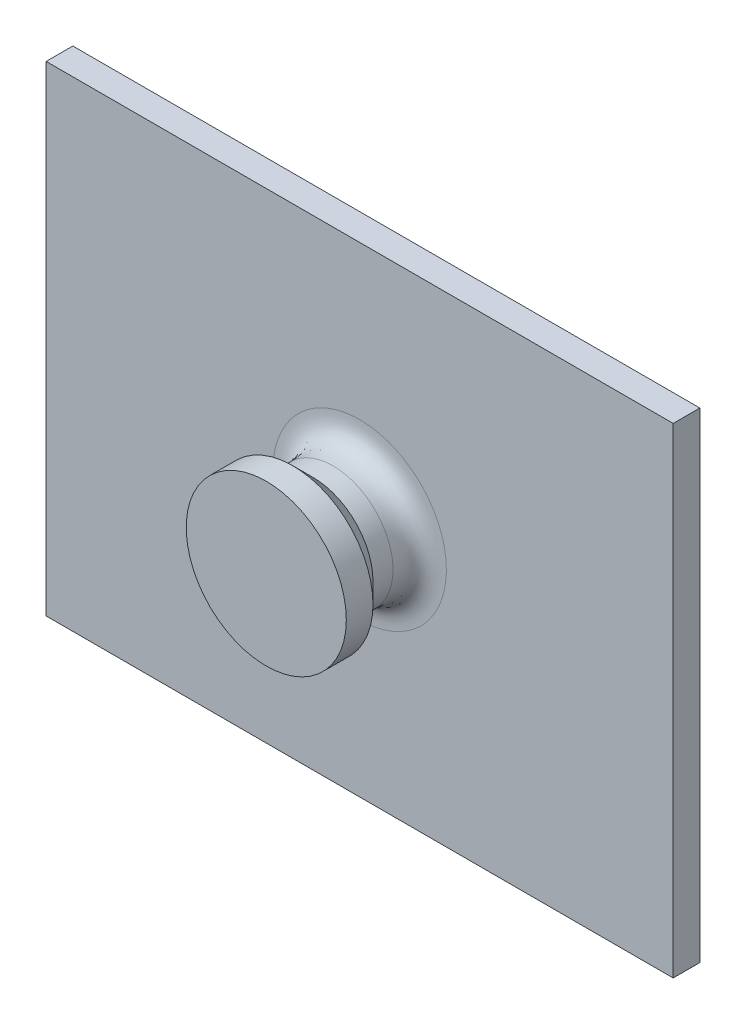
ISO-10303-21;
HEADER;
FILE_DESCRIPTION(('STEP AP214'),'2;1');
FILE_NAME('part.step','',(''),(''),'','','');
FILE_SCHEMA(('AUTOMOTIVE_DESIGN { 1 0 10303 214 1 1 1 1 }'));
ENDSEC;
DATA;
#1=APPLICATION_CONTEXT('core data for automotive mechanical design processes');
#2=APPLICATION_PROTOCOL_DEFINITION('international standard','automotive_design',2000,#1);
#3=PRODUCT_CONTEXT('',#1,'mechanical');
#4=PRODUCT('Part','Part','',(#3));
#5=PRODUCT_RELATED_PRODUCT_CATEGORY('part','',(#4));
#6=PRODUCT_DEFINITION_FORMATION('','',#4);
#7=PRODUCT_DEFINITION_CONTEXT('part definition',#1,'design');
#8=PRODUCT_DEFINITION('design','',#6,#7);
#9=PRODUCT_DEFINITION_SHAPE('','',#8);
#10=(LENGTH_UNIT() NAMED_UNIT(*) SI_UNIT(.MILLI.,.METRE.));
#11=(NAMED_UNIT(*) PLANE_ANGLE_UNIT() SI_UNIT($,.RADIAN.));
#12=(NAMED_UNIT(*) SI_UNIT($,.STERADIAN.) SOLID_ANGLE_UNIT());
#13=UNCERTAINTY_MEASURE_WITH_UNIT(LENGTH_MEASURE(1.E-05),#10,'distance_accuracy_value','');
#14=(GEOMETRIC_REPRESENTATION_CONTEXT(3) GLOBAL_UNCERTAINTY_ASSIGNED_CONTEXT((#13)) GLOBAL_UNIT_ASSIGNED_CONTEXT((#10,
#11,#12)) REPRESENTATION_CONTEXT('',''));
#15=CARTESIAN_POINT('',(0.,0.,0.));
#16=DIRECTION('',(0.,0.,1.));
#17=DIRECTION('',(1.,0.,0.));
#18=AXIS2_PLACEMENT_3D('',#15,#16,#17);
#19=CARTESIAN_POINT('',(0.,10.3478260869565,2.));
#20=DIRECTION('',(1.,0.,0.));
#21=DIRECTION('',(0.,0.,-1.));
#22=AXIS2_PLACEMENT_3D('',#19,#20,#21);
#23=PLANE('',#22);
#24=DIRECTION('',(0.,-1.,0.));
#25=VECTOR('',#24,1.);
#26=CARTESIAN_POINT('',(0.,10.3478260869565,0.));
#27=LINE('',#26,#25);
#28=CARTESIAN_POINT('',(0.,46.3478260869565,0.));
#29=VERTEX_POINT('',#28);
#30=CARTESIAN_POINT('',(0.,10.3478260869565,0.));
#31=VERTEX_POINT('',#30);
#32=EDGE_CURVE('E119',#29,#31,#27,.T.);
#33=ORIENTED_EDGE('',*,*,#32,.T.);
#34=DIRECTION('',(0.,0.,-1.));
#35=VECTOR('',#34,1.);
#36=CARTESIAN_POINT('',(0.,10.3478260869565,2.));
#37=LINE('',#36,#35);
#38=CARTESIAN_POINT('',(0.,10.3478260869565,2.));
#39=VERTEX_POINT('',#38);
#40=EDGE_CURVE('E108',#39,#31,#37,.T.);
#41=ORIENTED_EDGE('',*,*,#40,.F.);
#42=DIRECTION('',(0.,-1.,0.));
#43=VECTOR('',#42,1.);
#44=CARTESIAN_POINT('',(0.,10.3478260869565,2.));
#45=LINE('',#44,#43);
#46=CARTESIAN_POINT('',(0.,46.3478260869565,2.));
#47=VERTEX_POINT('',#46);
#48=EDGE_CURVE('E100',#47,#39,#45,.T.);
#49=ORIENTED_EDGE('',*,*,#48,.F.);
#50=DIRECTION('',(0.,0.,-1.));
#51=VECTOR('',#50,1.);
#52=CARTESIAN_POINT('',(0.,46.3478260869565,2.));
#53=LINE('',#52,#51);
#54=EDGE_CURVE('E115',#47,#29,#53,.T.);
#55=ORIENTED_EDGE('',*,*,#54,.T.);
#56=EDGE_LOOP('',(#33,#41,#49,#55));
#57=FACE_BOUND('',#56,.T.);
#58=ADVANCED_FACE('F45',(#57),#23,.F.);
#59=CARTESIAN_POINT('',(0.,10.3478260869565,2.));
#60=DIRECTION('',(0.,1.,0.));
#61=DIRECTION('',(0.,0.,1.));
#62=AXIS2_PLACEMENT_3D('',#59,#60,#61);
#63=PLANE('',#62);
#64=DIRECTION('',(1.,0.,0.));
#65=VECTOR('',#64,1.);
#66=CARTESIAN_POINT('',(0.,10.3478260869565,0.));
#67=LINE('',#66,#65);
#68=CARTESIAN_POINT('',(47.,10.3478260869565,0.));
#69=VERTEX_POINT('',#68);
#70=EDGE_CURVE('E106',#31,#69,#67,.T.);
#71=ORIENTED_EDGE('',*,*,#70,.T.);
#72=DIRECTION('',(0.,0.,-1.));
#73=VECTOR('',#72,1.);
#74=CARTESIAN_POINT('',(47.,10.3478260869565,2.));
#75=LINE('',#74,#73);
#76=CARTESIAN_POINT('',(47.,10.3478260869565,2.));
#77=VERTEX_POINT('',#76);
#78=EDGE_CURVE('E104',#77,#69,#75,.T.);
#79=ORIENTED_EDGE('',*,*,#78,.F.);
#80=DIRECTION('',(1.,0.,0.));
#81=VECTOR('',#80,1.);
#82=CARTESIAN_POINT('',(0.,10.3478260869565,2.));
#83=LINE('',#82,#81);
#84=EDGE_CURVE('E95',#39,#77,#83,.T.);
#85=ORIENTED_EDGE('',*,*,#84,.F.);
#86=ORIENTED_EDGE('',*,*,#40,.T.);
#87=EDGE_LOOP('',(#71,#79,#85,#86));
#88=FACE_BOUND('',#87,.T.);
#89=ADVANCED_FACE('F105',(#88),#63,.F.);
#90=CARTESIAN_POINT('',(47.,10.3478260869565,2.));
#91=DIRECTION('',(-1.,0.,0.));
#92=DIRECTION('',(0.,-1.,0.));
#93=AXIS2_PLACEMENT_3D('',#90,#91,#92);
#94=PLANE('',#93);
#95=DIRECTION('',(0.,1.,0.));
#96=VECTOR('',#95,1.);
#97=CARTESIAN_POINT('',(47.,10.3478260869565,0.));
#98=LINE('',#97,#96);
#99=CARTESIAN_POINT('',(47.,46.3478260869565,0.));
#100=VERTEX_POINT('',#99);
#101=EDGE_CURVE('E81',#69,#100,#98,.T.);
#102=ORIENTED_EDGE('',*,*,#101,.T.);
#103=DIRECTION('',(0.,0.,-1.));
#104=VECTOR('',#103,1.);
#105=CARTESIAN_POINT('',(47.,46.3478260869565,2.));
#106=LINE('',#105,#104);
#107=CARTESIAN_POINT('',(47.,46.3478260869565,2.));
#108=VERTEX_POINT('',#107);
#109=EDGE_CURVE('E109',#108,#100,#106,.T.);
#110=ORIENTED_EDGE('',*,*,#109,.F.);
#111=DIRECTION('',(0.,1.,0.));
#112=VECTOR('',#111,1.);
#113=CARTESIAN_POINT('',(47.,10.3478260869565,2.));
#114=LINE('',#113,#112);
#115=EDGE_CURVE('E98',#77,#108,#114,.T.);
#116=ORIENTED_EDGE('',*,*,#115,.F.);
#117=ORIENTED_EDGE('',*,*,#78,.T.);
#118=EDGE_LOOP('',(#102,#110,#116,#117));
#119=FACE_BOUND('',#118,.T.);
#120=ADVANCED_FACE('F111',(#119),#94,.F.);
#121=CARTESIAN_POINT('',(0.,46.3478260869565,2.));
#122=DIRECTION('',(0.,-1.,0.));
#123=DIRECTION('',(0.,0.,-1.));
#124=AXIS2_PLACEMENT_3D('',#121,#122,#123);
#125=PLANE('',#124);
#126=DIRECTION('',(-1.,0.,0.));
#127=VECTOR('',#126,1.);
#128=CARTESIAN_POINT('',(0.,46.3478260869565,0.));
#129=LINE('',#128,#127);
#130=EDGE_CURVE('E87',#100,#29,#129,.T.);
#131=ORIENTED_EDGE('',*,*,#130,.T.);
#132=ORIENTED_EDGE('',*,*,#54,.F.);
#133=DIRECTION('',(-1.,0.,0.));
#134=VECTOR('',#133,1.);
#135=CARTESIAN_POINT('',(0.,46.3478260869565,2.));
#136=LINE('',#135,#134);
#137=EDGE_CURVE('E64',#108,#47,#136,.T.);
#138=ORIENTED_EDGE('',*,*,#137,.F.);
#139=ORIENTED_EDGE('',*,*,#109,.T.);
#140=EDGE_LOOP('',(#131,#132,#138,#139));
#141=FACE_BOUND('',#140,.T.);
#142=ADVANCED_FACE('F164',(#141),#125,.F.);
#143=CARTESIAN_POINT('',(0.,0.,2.));
#144=DIRECTION('',(0.,0.,-1.));
#145=DIRECTION('',(-1.,0.,0.));
#146=AXIS2_PLACEMENT_3D('',#143,#144,#145);
#147=PLANE('',#146);
#148=CARTESIAN_POINT('',(30.,28.3478260869565,2.));
#149=CARTESIAN_POINT('',(30.,29.1985596013557,2.));
#150=CARTESIAN_POINT('',(29.6615571652833,30.900026630154,2.));
#151=CARTESIAN_POINT('',(28.2158516894486,33.0636777764052,2.));
#152=CARTESIAN_POINT('',(26.0522005431975,34.5093832522398,2.));
#153=CARTESIAN_POINT('',(23.5,35.0170475043149,2.));
#154=CARTESIAN_POINT('',(20.9477994568025,34.5093832522398,2.));
#155=CARTESIAN_POINT('',(18.7841483105513,33.0636777764052,2.));
#156=CARTESIAN_POINT('',(17.3384428347167,30.900026630154,2.));
#157=CARTESIAN_POINT('',(16.8307785826416,28.3478260869565,2.));
#158=CARTESIAN_POINT('',(17.3384428347167,25.7956255437591,2.));
#159=CARTESIAN_POINT('',(18.7841483105513,23.6319743975079,2.));
#160=CARTESIAN_POINT('',(20.9477994568025,22.1862689216732,2.));
#161=CARTESIAN_POINT('',(23.5,21.6786046695982,2.));
#162=CARTESIAN_POINT('',(26.0522005431975,22.1862689216733,2.));
#163=CARTESIAN_POINT('',(28.2158516894486,23.6319743975079,2.));
#164=CARTESIAN_POINT('',(29.6615571652833,25.7956255437591,2.));
#165=CARTESIAN_POINT('',(30.,27.4970925725574,2.));
#166=CARTESIAN_POINT('',(30.,28.3478260869565,2.));
#167=B_SPLINE_CURVE_WITH_KNOTS('',3,(#148,#149,#150,#151,#152,#153,#154,#155,#156,#157,#158,
#159,#160,#161,#162,#163,#164,#165,#166),.UNSPECIFIED.,.T.,.F.,(4,1,1,1,1,1,1,1,1,1,1,1,1,1,1,1,
4),(-3.14159265358979,-2.74889357189107,-2.35619449019234,-1.96349540849362,-1.5707963267949,
-1.17809724509617,-0.785398163397448,-0.392699081698724,0.,0.392699081698724,0.785398163397448,
1.17809724509617,1.5707963267949,1.96349540849362,2.35619449019235,2.74889357189107,
3.14159265358979),.UNSPECIFIED.);
#168=CARTESIAN_POINT('',(30.,28.3478260869565,2.));
#169=VERTEX_POINT('',#168);
#170=EDGE_CURVE('E56',#169,#169,#167,.F.);
#171=ORIENTED_EDGE('',*,*,#170,.T.);
#172=EDGE_LOOP('',(#171));
#173=FACE_BOUND('',#172,.T.);
#174=ORIENTED_EDGE('',*,*,#48,.T.);
#175=ORIENTED_EDGE('',*,*,#84,.T.);
#176=ORIENTED_EDGE('',*,*,#115,.T.);
#177=ORIENTED_EDGE('',*,*,#137,.T.);
#178=EDGE_LOOP('',(#174,#175,#176,#177));
#179=FACE_BOUND('',#178,.T.);
#180=ADVANCED_FACE('F96',(#173,#179),#147,.F.);
#181=CARTESIAN_POINT('',(0.,0.,0.));
#182=DIRECTION('',(0.,0.,-1.));
#183=DIRECTION('',(-1.,0.,0.));
#184=AXIS2_PLACEMENT_3D('',#181,#182,#183);
#185=PLANE('',#184);
#186=ORIENTED_EDGE('',*,*,#32,.F.);
#187=ORIENTED_EDGE('',*,*,#130,.F.);
#188=ORIENTED_EDGE('',*,*,#101,.F.);
#189=ORIENTED_EDGE('',*,*,#70,.F.);
#190=EDGE_LOOP('',(#186,#187,#188,#189));
#191=FACE_BOUND('',#190,.T.);
#192=ADVANCED_FACE('F158',(#191),#185,.T.);
#193=CARTESIAN_POINT('',(23.5,28.3478260869565,7.));
#194=DIRECTION('',(0.,0.,-1.));
#195=DIRECTION('',(-1.,0.,0.));
#196=AXIS2_PLACEMENT_3D('',#193,#194,#195);
#197=CYLINDRICAL_SURFACE('',#196,4.5);
#198=CARTESIAN_POINT('',(23.5,28.3478260869565,5.50000000000002));
#199=DIRECTION('',(0.,0.,1.));
#200=DIRECTION('',(1.,0.,0.));
#201=AXIS2_PLACEMENT_3D('',#198,#199,#200);
#202=CIRCLE('',#201,4.5);
#203=CARTESIAN_POINT('',(28.,28.3478260869565,5.50000000000002));
#204=VERTEX_POINT('',#203);
#205=EDGE_CURVE('E11',#204,#204,#202,.F.);
#206=ORIENTED_EDGE('',*,*,#205,.T.);
#207=EDGE_LOOP('',(#206));
#208=FACE_BOUND('',#207,.T.);
#209=CARTESIAN_POINT('',(28.,28.3478260869565,4.));
#210=CARTESIAN_POINT('',(28.,27.758856730834,4.));
#211=CARTESIAN_POINT('',(27.7656934221192,26.5809180185891,4.));
#212=CARTESIAN_POINT('',(26.7648204003875,25.083005686569,4.));
#213=CARTESIAN_POINT('',(25.2669080683675,24.0821326648373,4.));
#214=CARTESIAN_POINT('',(23.5,23.7306727980161,4.));
#215=CARTESIAN_POINT('',(21.7330919316325,24.0821326648373,4.));
#216=CARTESIAN_POINT('',(20.2351795996125,25.083005686569,4.));
#217=CARTESIAN_POINT('',(19.2343065778808,26.5809180185891,4.));
#218=CARTESIAN_POINT('',(18.8828467110596,28.3478260869565,4.));
#219=CARTESIAN_POINT('',(19.2343065778808,30.114734155324,4.));
#220=CARTESIAN_POINT('',(20.2351795996125,31.6126464873441,4.));
#221=CARTESIAN_POINT('',(21.7330919316325,32.6135195090758,4.));
#222=CARTESIAN_POINT('',(23.5,32.9649793758969,4.));
#223=CARTESIAN_POINT('',(25.2669080683675,32.6135195090758,4.));
#224=CARTESIAN_POINT('',(26.7648204003875,31.612646487344,4.));
#225=CARTESIAN_POINT('',(27.7656934221192,30.114734155324,4.));
#226=CARTESIAN_POINT('',(28.,28.936795443079,4.));
#227=CARTESIAN_POINT('',(28.,28.3478260869565,4.));
#228=B_SPLINE_CURVE_WITH_KNOTS('',3,(#209,#210,#211,#212,#213,#214,#215,#216,#217,#218,#219,
#220,#221,#222,#223,#224,#225,#226,#227),.UNSPECIFIED.,.T.,.F.,(4,1,1,1,1,1,1,1,1,1,1,1,1,1,1,1,
4),(-3.14159265358979,-2.74889357189107,-2.35619449019235,-1.96349540849362,-1.5707963267949,
-1.17809724509617,-0.785398163397448,-0.392699081698724,0.,0.392699081698724,0.785398163397448,
1.17809724509617,1.5707963267949,1.96349540849362,2.35619449019234,2.74889357189107,
3.14159265358979),.UNSPECIFIED.);
#229=CARTESIAN_POINT('',(28.,28.3478260869565,4.));
#230=VERTEX_POINT('',#229);
#231=EDGE_CURVE('E136',#230,#230,#228,.F.);
#232=ORIENTED_EDGE('',*,*,#231,.T.);
#233=EDGE_LOOP('',(#232));
#234=FACE_BOUND('',#233,.T.);
#235=ADVANCED_FACE('F147',(#208,#234),#197,.T.);
#236=CARTESIAN_POINT('',(23.5,28.3478260869565,9.));
#237=DIRECTION('',(0.,0.,-1.));
#238=DIRECTION('',(-1.,0.,0.));
#239=AXIS2_PLACEMENT_3D('',#236,#237,#238);
#240=CYLINDRICAL_SURFACE('',#239,6.);
#241=CARTESIAN_POINT('',(23.5,28.3478260869565,9.));
#242=DIRECTION('',(0.,0.,1.));
#243=DIRECTION('',(1.,0.,0.));
#244=AXIS2_PLACEMENT_3D('',#241,#242,#243);
#245=CIRCLE('',#244,6.);
#246=CARTESIAN_POINT('',(29.5,28.3478260869565,9.));
#247=VERTEX_POINT('',#246);
#248=EDGE_CURVE('E123',#247,#247,#245,.T.);
#249=ORIENTED_EDGE('',*,*,#248,.F.);
#250=EDGE_LOOP('',(#249));
#251=FACE_BOUND('',#250,.T.);
#252=CARTESIAN_POINT('',(23.5,28.3478260869565,7.));
#253=DIRECTION('',(0.,0.,1.));
#254=DIRECTION('',(1.,0.,0.));
#255=AXIS2_PLACEMENT_3D('',#252,#253,#254);
#256=CIRCLE('',#255,6.);
#257=CARTESIAN_POINT('',(29.5,28.3478260869565,7.));
#258=VERTEX_POINT('',#257);
#259=EDGE_CURVE('E317',#258,#258,#256,.T.);
#260=ORIENTED_EDGE('',*,*,#259,.T.);
#261=EDGE_LOOP('',(#260));
#262=FACE_BOUND('',#261,.T.);
#263=ADVANCED_FACE('F157',(#251,#262),#240,.T.);
#264=CARTESIAN_POINT('',(23.5,28.3478260869565,9.));
#265=DIRECTION('',(0.,0.,1.));
#266=DIRECTION('',(1.,0.,0.));
#267=AXIS2_PLACEMENT_3D('',#264,#265,#266);
#268=PLANE('',#267);
#269=ORIENTED_EDGE('',*,*,#248,.T.);
#270=EDGE_LOOP('',(#269));
#271=FACE_BOUND('',#270,.T.);
#272=ADVANCED_FACE('F195',(#271),#268,.T.);
#273=CARTESIAN_POINT('',(30.,28.3478260869565,2.));
#274=CARTESIAN_POINT('',(30.,27.4970925725574,2.));
#275=CARTESIAN_POINT('',(29.6615571652833,25.7956255437591,2.));
#276=CARTESIAN_POINT('',(28.2158516894486,23.6319743975079,2.));
#277=CARTESIAN_POINT('',(26.0522005431975,22.1862689216733,2.));
#278=CARTESIAN_POINT('',(23.5,21.6786046695982,2.));
#279=CARTESIAN_POINT('',(20.9477994568025,22.1862689216732,2.));
#280=CARTESIAN_POINT('',(18.7841483105513,23.6319743975079,2.));
#281=CARTESIAN_POINT('',(17.3384428347167,25.7956255437591,2.));
#282=CARTESIAN_POINT('',(16.8307785826416,28.3478260869565,2.));
#283=CARTESIAN_POINT('',(17.3384428347167,30.900026630154,2.));
#284=CARTESIAN_POINT('',(18.7841483105513,33.0636777764052,2.));
#285=CARTESIAN_POINT('',(20.9477994568025,34.5093832522398,2.));
#286=CARTESIAN_POINT('',(23.5,35.0170475043149,2.));
#287=CARTESIAN_POINT('',(26.0522005431975,34.5093832522398,2.));
#288=CARTESIAN_POINT('',(28.2158516894486,33.0636777764052,2.));
#289=CARTESIAN_POINT('',(29.6615571652833,30.900026630154,2.));
#290=CARTESIAN_POINT('',(30.,29.1985596013557,2.));
#291=CARTESIAN_POINT('',(30.,28.3478260869565,2.));
#292=CARTESIAN_POINT('',(29.6636038969321,28.3478260869565,2.));
#293=CARTESIAN_POINT('',(29.6636038969321,27.5411207939409,2.));
#294=CARTESIAN_POINT('',(29.3426765777093,25.9277102079098,2.));
#295=CARTESIAN_POINT('',(27.9717910539137,23.8760350330427,2.));
#296=CARTESIAN_POINT('',(25.9201158790468,22.5051495092473,2.));
#297=CARTESIAN_POINT('',(23.5,22.023758530413,2.));
#298=CARTESIAN_POINT('',(21.0798841209532,22.5051495092473,2.));
#299=CARTESIAN_POINT('',(19.0282089460862,23.8760350330428,2.));
#300=CARTESIAN_POINT('',(17.6573234222908,25.9277102079097,2.));
#301=CARTESIAN_POINT('',(17.1759324434564,28.3478260869565,2.));
#302=CARTESIAN_POINT('',(17.6573234222908,30.7679419660033,2.));
#303=CARTESIAN_POINT('',(19.0282089460862,32.8196171408703,2.));
#304=CARTESIAN_POINT('',(21.0798841209532,34.1905026646658,2.));
#305=CARTESIAN_POINT('',(23.5,34.6718936435001,2.));
#306=CARTESIAN_POINT('',(25.9201158790468,34.1905026646658,2.));
#307=CARTESIAN_POINT('',(27.9717910539138,32.8196171408703,2.));
#308=CARTESIAN_POINT('',(29.3426765777092,30.7679419660033,2.));
#309=CARTESIAN_POINT('',(29.6636038969321,29.1545313799721,2.));
#310=CARTESIAN_POINT('',(29.6636038969321,28.3478260869565,2.));
#311=CARTESIAN_POINT('',(29.3272077938642,28.3478260869565,2.));
#312=CARTESIAN_POINT('',(29.3272077938642,27.5851490153245,2.));
#313=CARTESIAN_POINT('',(29.0237959901352,26.0597948720604,2.));
#314=CARTESIAN_POINT('',(27.7277304183789,24.1200956685776,2.));
#315=CARTESIAN_POINT('',(25.7880312148961,22.8240300968213,2.));
#316=CARTESIAN_POINT('',(23.5,22.3689123912278,2.));
#317=CARTESIAN_POINT('',(21.2119687851039,22.8240300968213,2.));
#318=CARTESIAN_POINT('',(19.2722695816211,24.1200956685776,2.));
#319=CARTESIAN_POINT('',(17.9762040098648,26.0597948720604,2.));
#320=CARTESIAN_POINT('',(17.5210863042713,28.3478260869565,2.));
#321=CARTESIAN_POINT('',(17.9762040098648,30.6358573018527,2.));
#322=CARTESIAN_POINT('',(19.2722695816211,32.5755565053354,2.));
#323=CARTESIAN_POINT('',(21.2119687851039,33.8716220770917,2.));
#324=CARTESIAN_POINT('',(23.5,34.3267397826852,2.));
#325=CARTESIAN_POINT('',(25.7880312148961,33.8716220770917,2.));
#326=CARTESIAN_POINT('',(27.7277304183789,32.5755565053354,2.));
#327=CARTESIAN_POINT('',(29.0237959901352,30.6358573018527,2.));
#328=CARTESIAN_POINT('',(29.3272077938642,29.1105031585886,2.));
#329=CARTESIAN_POINT('',(29.3272077938642,28.3478260869565,2.));
#330=CARTESIAN_POINT('',(28.5857864376269,28.3478260869565,2.14338383967217));
#331=CARTESIAN_POINT('',(28.5857864376269,27.6821877839464,2.14338383967217));
#332=CARTESIAN_POINT('',(28.3209790562863,26.3509111779261,2.14338383967217));
#333=CARTESIAN_POINT('',(27.1898176252396,24.6580084617168,2.14338383967216));
#334=CARTESIAN_POINT('',(25.4969149090304,23.5268470306703,2.14338383967217));
#335=CARTESIAN_POINT('',(23.5,23.1296359586593,2.14338383967217));
#336=CARTESIAN_POINT('',(21.5030850909696,23.5268470306703,2.14338383967217));
#337=CARTESIAN_POINT('',(19.8101823747603,24.6580084617169,2.14338383967217));
#338=CARTESIAN_POINT('',(18.6790209437137,26.3509111779261,2.14338383967217));
#339=CARTESIAN_POINT('',(18.2818098717028,28.3478260869565,2.14338383967217));
#340=CARTESIAN_POINT('',(18.6790209437137,30.3447409959869,2.14338383967217));
#341=CARTESIAN_POINT('',(19.8101823747603,32.0376437121962,2.14338383967217));
#342=CARTESIAN_POINT('',(21.5030850909696,33.1688051432428,2.14338383967217));
#343=CARTESIAN_POINT('',(23.5,33.5660162152537,2.14338383967217));
#344=CARTESIAN_POINT('',(25.4969149090304,33.1688051432428,2.14338383967216));
#345=CARTESIAN_POINT('',(27.1898176252397,32.0376437121962,2.14338383967217));
#346=CARTESIAN_POINT('',(28.3209790562862,30.344740995987,2.14338383967216));
#347=CARTESIAN_POINT('',(28.5857864376269,29.0134643899667,2.14338383967217));
#348=CARTESIAN_POINT('',(28.5857864376269,28.3478260869565,2.14338383967217));
#349=CARTESIAN_POINT('',(28.1433838396722,28.3478260869565,2.5857864376269));
#350=CARTESIAN_POINT('',(28.1433838396722,27.7400903557829,2.5857864376269));
#351=CARTESIAN_POINT('',(27.9016115336143,26.5246188934357,2.58578643762691));
#352=CARTESIAN_POINT('',(26.8688476192425,24.978978467714,2.5857864376269));
#353=CARTESIAN_POINT('',(25.3232071935209,23.9462145533423,2.58578643762691));
#354=CARTESIAN_POINT('',(23.5,23.5835560942554,2.5857864376269));
#355=CARTESIAN_POINT('',(21.6767928064791,23.9462145533423,2.58578643762691));
#356=CARTESIAN_POINT('',(20.1311523807574,24.978978467714,2.5857864376269));
#357=CARTESIAN_POINT('',(19.0983884663857,26.5246188934357,2.58578643762691));
#358=CARTESIAN_POINT('',(18.7357300072989,28.3478260869565,2.5857864376269));
#359=CARTESIAN_POINT('',(19.0983884663857,30.1710332804774,2.58578643762691));
#360=CARTESIAN_POINT('',(20.1311523807574,31.7166737061991,2.5857864376269));
#361=CARTESIAN_POINT('',(21.6767928064791,32.7494376205708,2.58578643762691));
#362=CARTESIAN_POINT('',(23.5,33.1120960796576,2.5857864376269));
#363=CARTESIAN_POINT('',(25.3232071935209,32.7494376205708,2.58578643762691));
#364=CARTESIAN_POINT('',(26.8688476192425,31.7166737061991,2.5857864376269));
#365=CARTESIAN_POINT('',(27.9016115336143,30.1710332804774,2.58578643762691));
#366=CARTESIAN_POINT('',(28.1433838396722,28.9555618181302,2.5857864376269));
#367=CARTESIAN_POINT('',(28.1433838396722,28.3478260869565,2.5857864376269));
#368=CARTESIAN_POINT('',(28.,28.3478260869565,3.32720779386422));
#369=CARTESIAN_POINT('',(28.,27.758856730834,3.32720779386422));
#370=CARTESIAN_POINT('',(27.7656934221192,26.5809180185891,3.32720779386422));
#371=CARTESIAN_POINT('',(26.7648204003875,25.083005686569,3.32720779386421));
#372=CARTESIAN_POINT('',(25.2669080683675,24.0821326648373,3.32720779386422));
#373=CARTESIAN_POINT('',(23.5,23.7306727980161,3.32720779386421));
#374=CARTESIAN_POINT('',(21.7330919316325,24.0821326648373,3.32720779386421));
#375=CARTESIAN_POINT('',(20.2351795996125,25.083005686569,3.32720779386422));
#376=CARTESIAN_POINT('',(19.2343065778808,26.5809180185891,3.32720779386421));
#377=CARTESIAN_POINT('',(18.8828467110596,28.3478260869565,3.32720779386421));
#378=CARTESIAN_POINT('',(19.2343065778808,30.114734155324,3.32720779386421));
#379=CARTESIAN_POINT('',(20.2351795996125,31.6126464873441,3.32720779386422));
#380=CARTESIAN_POINT('',(21.7330919316325,32.6135195090758,3.32720779386422));
#381=CARTESIAN_POINT('',(23.5,32.9649793758969,3.32720779386421));
#382=CARTESIAN_POINT('',(25.2669080683675,32.6135195090758,3.32720779386421));
#383=CARTESIAN_POINT('',(26.7648204003875,31.612646487344,3.32720779386422));
#384=CARTESIAN_POINT('',(27.7656934221192,30.114734155324,3.32720779386421));
#385=CARTESIAN_POINT('',(28.,28.936795443079,3.32720779386422));
#386=CARTESIAN_POINT('',(28.,28.3478260869565,3.32720779386422));
#387=CARTESIAN_POINT('',(28.,28.3478260869565,3.66360389693211));
#388=CARTESIAN_POINT('',(28.,27.758856730834,3.66360389693211));
#389=CARTESIAN_POINT('',(27.7656934221192,26.5809180185891,3.66360389693211));
#390=CARTESIAN_POINT('',(26.7648204003875,25.083005686569,3.66360389693211));
#391=CARTESIAN_POINT('',(25.2669080683675,24.0821326648373,3.66360389693211));
#392=CARTESIAN_POINT('',(23.5,23.7306727980161,3.66360389693211));
#393=CARTESIAN_POINT('',(21.7330919316325,24.0821326648373,3.66360389693211));
#394=CARTESIAN_POINT('',(20.2351795996125,25.083005686569,3.66360389693211));
#395=CARTESIAN_POINT('',(19.2343065778808,26.5809180185891,3.66360389693211));
#396=CARTESIAN_POINT('',(18.8828467110596,28.3478260869565,3.66360389693211));
#397=CARTESIAN_POINT('',(19.2343065778808,30.114734155324,3.66360389693211));
#398=CARTESIAN_POINT('',(20.2351795996125,31.6126464873441,3.66360389693211));
#399=CARTESIAN_POINT('',(21.7330919316325,32.6135195090758,3.66360389693211));
#400=CARTESIAN_POINT('',(23.5,32.9649793758969,3.66360389693211));
#401=CARTESIAN_POINT('',(25.2669080683675,32.6135195090758,3.66360389693211));
#402=CARTESIAN_POINT('',(26.7648204003875,31.612646487344,3.66360389693211));
#403=CARTESIAN_POINT('',(27.7656934221192,30.114734155324,3.66360389693211));
#404=CARTESIAN_POINT('',(28.,28.936795443079,3.66360389693211));
#405=CARTESIAN_POINT('',(28.,28.3478260869565,3.66360389693211));
#406=CARTESIAN_POINT('',(28.,28.3478260869565,4.));
#407=CARTESIAN_POINT('',(28.,27.758856730834,4.));
#408=CARTESIAN_POINT('',(27.7656934221192,26.5809180185891,4.));
#409=CARTESIAN_POINT('',(26.7648204003875,25.083005686569,4.));
#410=CARTESIAN_POINT('',(25.2669080683675,24.0821326648373,4.));
#411=CARTESIAN_POINT('',(23.5,23.7306727980161,4.));
#412=CARTESIAN_POINT('',(21.7330919316325,24.0821326648373,4.));
#413=CARTESIAN_POINT('',(20.2351795996125,25.083005686569,4.));
#414=CARTESIAN_POINT('',(19.2343065778808,26.5809180185891,4.));
#415=CARTESIAN_POINT('',(18.8828467110596,28.3478260869565,4.));
#416=CARTESIAN_POINT('',(19.2343065778808,30.114734155324,4.));
#417=CARTESIAN_POINT('',(20.2351795996125,31.6126464873441,4.));
#418=CARTESIAN_POINT('',(21.7330919316325,32.6135195090758,4.));
#419=CARTESIAN_POINT('',(23.5,32.9649793758969,4.));
#420=CARTESIAN_POINT('',(25.2669080683675,32.6135195090758,4.));
#421=CARTESIAN_POINT('',(26.7648204003875,31.612646487344,4.));
#422=CARTESIAN_POINT('',(27.7656934221192,30.114734155324,4.));
#423=CARTESIAN_POINT('',(28.,28.936795443079,4.));
#424=CARTESIAN_POINT('',(28.,28.3478260869565,4.));
#425=B_SPLINE_SURFACE_WITH_KNOTS('',5,3,((#273,#274,#275,#276,#277,#278,#279,#280,#281,#282,
#283,#284,#285,#286,#287,#288,#289,#290,#291),(#292,#293,#294,#295,#296,#297,#298,#299,#300,
#301,#302,#303,#304,#305,#306,#307,#308,#309,#310),(#311,#312,#313,#314,#315,#316,#317,#318,
#319,#320,#321,#322,#323,#324,#325,#326,#327,#328,#329),(#330,#331,#332,#333,#334,#335,#336,
#337,#338,#339,#340,#341,#342,#343,#344,#345,#346,#347,#348),(#349,#350,#351,#352,#353,#354,
#355,#356,#357,#358,#359,#360,#361,#362,#363,#364,#365,#366,#367),(#368,#369,#370,#371,#372,
#373,#374,#375,#376,#377,#378,#379,#380,#381,#382,#383,#384,#385,#386),(#387,#388,#389,#390,
#391,#392,#393,#394,#395,#396,#397,#398,#399,#400,#401,#402,#403,#404,#405),(#406,#407,#408,
#409,#410,#411,#412,#413,#414,#415,#416,#417,#418,#419,#420,#421,#422,#423,#424)),.UNSPECIFIED.,
.F.,.T.,.F.,(6,2,6),(4,1,1,1,1,1,1,1,1,1,1,1,1,1,1,1,4),(0.,0.5,1.),(-3.14159265358979,
-2.74889357189107,-2.35619449019235,-1.96349540849362,-1.5707963267949,-1.17809724509617,
-0.785398163397448,-0.392699081698724,0.,0.392699081698724,0.785398163397448,1.17809724509617,
1.5707963267949,1.96349540849362,2.35619449019234,2.74889357189107,3.14159265358979),.UNSPECIFIED.);
#426=ORIENTED_EDGE('',*,*,#170,.F.);
#427=EDGE_LOOP('',(#426));
#428=FACE_BOUND('',#427,.T.);
#429=ORIENTED_EDGE('',*,*,#231,.F.);
#430=EDGE_LOOP('',(#429));
#431=FACE_BOUND('',#430,.T.);
#432=ADVANCED_FACE('F182',(#428,#431),#425,.T.);
#433=CARTESIAN_POINT('',(23.5,28.3478260869565,7.));
#434=DIRECTION('',(0.,0.,1.));
#435=DIRECTION('',(1.,0.,0.));
#436=AXIS2_PLACEMENT_3D('',#433,#434,#435);
#437=CONICAL_SURFACE('',#436,6.,0.785398163397453);
#438=ORIENTED_EDGE('',*,*,#205,.F.);
#439=EDGE_LOOP('',(#438));
#440=FACE_BOUND('',#439,.T.);
#441=ORIENTED_EDGE('',*,*,#259,.F.);
#442=EDGE_LOOP('',(#441));
#443=FACE_BOUND('',#442,.T.);
#444=ADVANCED_FACE('F48',(#440,#443),#437,.T.);
#445=CLOSED_SHELL('',(#58,#89,#120,#142,#180,#192,#235,#263,#272,#432,#444));
#446=MANIFOLD_SOLID_BREP('B2',#445);
#447=ADVANCED_BREP_SHAPE_REPRESENTATION('',(#18,#446),#14);
#448=SHAPE_DEFINITION_REPRESENTATION(#9,#447);
ENDSEC;
END-ISO-10303-21;
